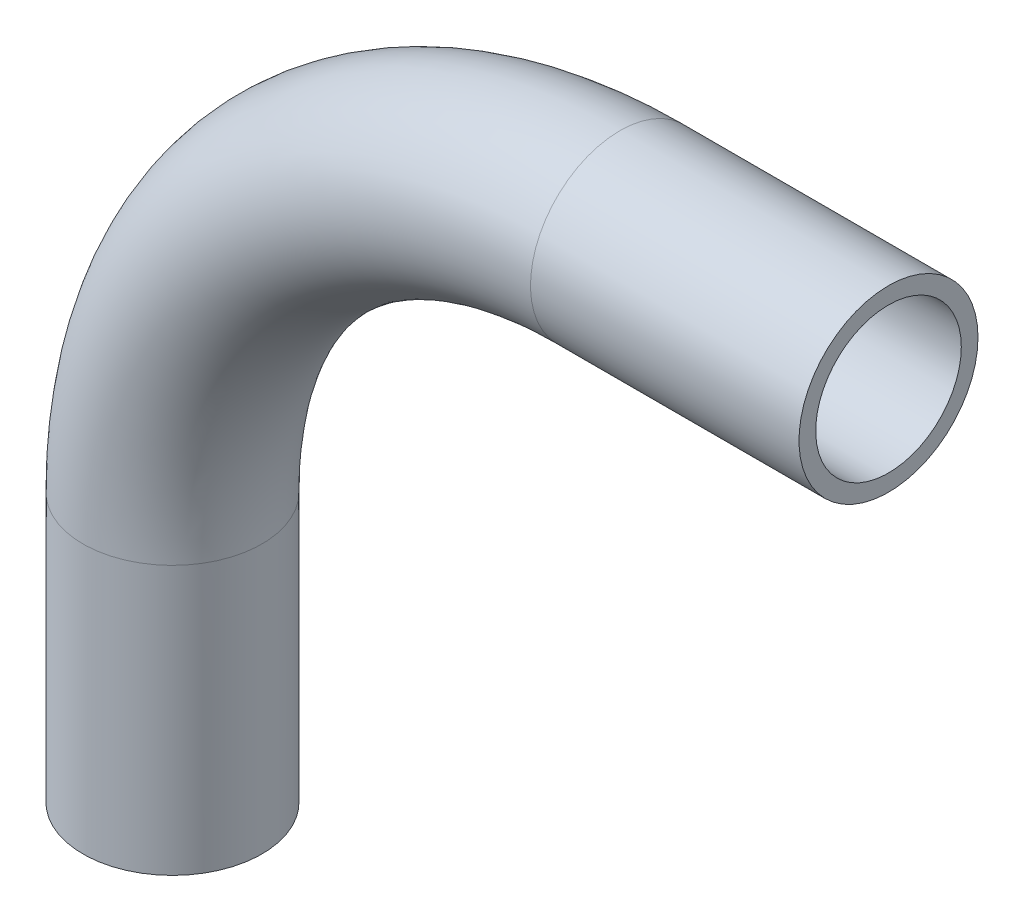
ISO-10303-21;
HEADER;
FILE_DESCRIPTION(('STEP AP214'),'2;1');
FILE_NAME('part.step','',(''),(''),'','','');
FILE_SCHEMA(('AUTOMOTIVE_DESIGN { 1 0 10303 214 1 1 1 1 }'));
ENDSEC;
DATA;
#1=APPLICATION_CONTEXT('core data for automotive mechanical design processes');
#2=APPLICATION_PROTOCOL_DEFINITION('international standard','automotive_design',2000,#1);
#3=PRODUCT_CONTEXT('',#1,'mechanical');
#4=PRODUCT('Part','Part','',(#3));
#5=PRODUCT_RELATED_PRODUCT_CATEGORY('part','',(#4));
#6=PRODUCT_DEFINITION_FORMATION('','',#4);
#7=PRODUCT_DEFINITION_CONTEXT('part definition',#1,'design');
#8=PRODUCT_DEFINITION('design','',#6,#7);
#9=PRODUCT_DEFINITION_SHAPE('','',#8);
#10=(LENGTH_UNIT() NAMED_UNIT(*) SI_UNIT(.MILLI.,.METRE.));
#11=(NAMED_UNIT(*) PLANE_ANGLE_UNIT() SI_UNIT($,.RADIAN.));
#12=(NAMED_UNIT(*) SI_UNIT($,.STERADIAN.) SOLID_ANGLE_UNIT());
#13=UNCERTAINTY_MEASURE_WITH_UNIT(LENGTH_MEASURE(1.E-05),#10,'distance_accuracy_value','');
#14=(GEOMETRIC_REPRESENTATION_CONTEXT(3) GLOBAL_UNCERTAINTY_ASSIGNED_CONTEXT((#13)) GLOBAL_UNIT_ASSIGNED_CONTEXT((#10,
#11,#12)) REPRESENTATION_CONTEXT('',''));
#15=CARTESIAN_POINT('',(0.,0.,0.));
#16=DIRECTION('',(0.,0.,1.));
#17=DIRECTION('',(1.,0.,0.));
#18=AXIS2_PLACEMENT_3D('',#15,#16,#17);
#19=CARTESIAN_POINT('',(-4.50164329221031E-13,-38.1,0.));
#20=DIRECTION('',(0.,1.,0.));
#21=DIRECTION('',(-1.,0.,0.));
#22=AXIS2_PLACEMENT_3D('',#19,#20,#21);
#23=CYLINDRICAL_SURFACE('',#22,4.7625);
#24=CARTESIAN_POINT('',(-2.81025203108243E-13,-23.8125000000001,0.));
#25=DIRECTION('',(0.,1.,0.));
#26=DIRECTION('',(0.,0.,-1.));
#27=AXIS2_PLACEMENT_3D('',#24,#25,#26);
#28=CIRCLE('',#27,4.7625);
#29=CARTESIAN_POINT('',(-4.76250000000028,-23.8125,0.));
#30=VERTEX_POINT('',#29);
#31=EDGE_CURVE('E85',#30,#30,#28,.T.);
#32=ORIENTED_EDGE('',*,*,#31,.F.);
#33=EDGE_LOOP('',(#32));
#34=FACE_BOUND('',#33,.T.);
#35=CARTESIAN_POINT('',(-4.50164329221031E-13,-38.1,0.));
#36=DIRECTION('',(0.,1.,0.));
#37=DIRECTION('',(0.,0.,-1.));
#38=AXIS2_PLACEMENT_3D('',#35,#36,#37);
#39=CIRCLE('',#38,4.7625);
#40=CARTESIAN_POINT('',(-4.50164329221031E-13,-38.1,-4.7625));
#41=VERTEX_POINT('',#40);
#42=EDGE_CURVE('E54',#41,#41,#39,.T.);
#43=ORIENTED_EDGE('',*,*,#42,.T.);
#44=EDGE_LOOP('',(#43));
#45=FACE_BOUND('',#44,.T.);
#46=ADVANCED_FACE('F39',(#34,#45),#23,.T.);
#47=CARTESIAN_POINT('',(23.8124999999997,-23.8125000000004,0.));
#48=DIRECTION('',(0.,0.,-1.));
#49=DIRECTION('',(-1.,0.,0.));
#50=AXIS2_PLACEMENT_3D('',#47,#48,#49);
#51=TOROIDAL_SURFACE('',#50,23.8125,4.7625);
#52=CARTESIAN_POINT('',(23.8125000000001,-3.629279499482E-13,0.));
#53=DIRECTION('',(1.,0.,0.));
#54=DIRECTION('',(0.,0.,-1.));
#55=AXIS2_PLACEMENT_3D('',#52,#53,#54);
#56=CIRCLE('',#55,4.7625);
#57=CARTESIAN_POINT('',(23.8125000000002,4.76249999999962,0.));
#58=VERTEX_POINT('',#57);
#59=EDGE_CURVE('E43',#58,#58,#56,.T.);
#60=CARTESIAN_POINT('',(23.8124999999997,-23.8125000000004,0.));
#61=DIRECTION('',(0.,0.,-1.));
#62=DIRECTION('',(-1.,0.,0.));
#63=AXIS2_PLACEMENT_3D('',#60,#61,#62);
#64=CIRCLE('',#63,28.575);
#65=EDGE_CURVE('',#30,#58,#64,.T.);
#66=ORIENTED_EDGE('',*,*,#31,.T.);
#67=ORIENTED_EDGE('',*,*,#59,.F.);
#68=ORIENTED_EDGE('',*,*,#65,.T.);
#69=ORIENTED_EDGE('',*,*,#65,.F.);
#70=EDGE_LOOP('',(#66,#68,#67,#69));
#71=FACE_BOUND('',#70,.T.);
#72=ADVANCED_FACE('F93',(#71),#51,.T.);
#73=CARTESIAN_POINT('',(23.8125000000001,-3.7470027081099E-13,0.));
#74=DIRECTION('',(1.,0.,0.));
#75=DIRECTION('',(0.,1.,0.));
#76=AXIS2_PLACEMENT_3D('',#73,#74,#75);
#77=CYLINDRICAL_SURFACE('',#76,4.7625);
#78=CARTESIAN_POINT('',(38.1,-5.97187481145209E-13,0.));
#79=DIRECTION('',(1.,0.,0.));
#80=DIRECTION('',(0.,0.,-1.));
#81=AXIS2_PLACEMENT_3D('',#78,#79,#80);
#82=CIRCLE('',#81,4.7625);
#83=CARTESIAN_POINT('',(38.1,-5.97187481145209E-13,-4.7625));
#84=VERTEX_POINT('',#83);
#85=EDGE_CURVE('E59',#84,#84,#82,.T.);
#86=ORIENTED_EDGE('',*,*,#85,.F.);
#87=EDGE_LOOP('',(#86));
#88=FACE_BOUND('',#87,.T.);
#89=ORIENTED_EDGE('',*,*,#59,.T.);
#90=EDGE_LOOP('',(#89));
#91=FACE_BOUND('',#90,.T.);
#92=ADVANCED_FACE('F41',(#88,#91),#77,.T.);
#93=CARTESIAN_POINT('',(-4.50164329221031E-13,-38.1,0.));
#94=DIRECTION('',(0.,1.,0.));
#95=DIRECTION('',(0.,0.,-1.));
#96=AXIS2_PLACEMENT_3D('',#93,#94,#95);
#97=PLANE('',#96);
#98=CARTESIAN_POINT('',(-4.50164329221031E-13,-38.1,0.));
#99=DIRECTION('',(0.,1.,0.));
#100=DIRECTION('',(0.,0.,-1.));
#101=AXIS2_PLACEMENT_3D('',#98,#99,#100);
#102=CIRCLE('',#101,3.8735);
#103=CARTESIAN_POINT('',(-4.50164329221031E-13,-38.1,-3.8735));
#104=VERTEX_POINT('',#103);
#105=EDGE_CURVE('E80',#104,#104,#102,.F.);
#106=ORIENTED_EDGE('',*,*,#105,.F.);
#107=EDGE_LOOP('',(#106));
#108=FACE_BOUND('',#107,.T.);
#109=ORIENTED_EDGE('',*,*,#42,.F.);
#110=EDGE_LOOP('',(#109));
#111=FACE_BOUND('',#110,.T.);
#112=ADVANCED_FACE('F99',(#108,#111),#97,.F.);
#113=CARTESIAN_POINT('',(38.1,-5.97187481145209E-13,0.));
#114=DIRECTION('',(1.,0.,0.));
#115=DIRECTION('',(0.,0.,-1.));
#116=AXIS2_PLACEMENT_3D('',#113,#114,#115);
#117=PLANE('',#116);
#118=CARTESIAN_POINT('',(38.1,-5.97187481145209E-13,0.));
#119=DIRECTION('',(1.,0.,0.));
#120=DIRECTION('',(0.,0.,-1.));
#121=AXIS2_PLACEMENT_3D('',#118,#119,#120);
#122=CIRCLE('',#121,3.8735);
#123=CARTESIAN_POINT('',(38.1,-5.97187481145209E-13,-3.8735));
#124=VERTEX_POINT('',#123);
#125=EDGE_CURVE('E11',#124,#124,#122,.F.);
#126=ORIENTED_EDGE('',*,*,#125,.T.);
#127=EDGE_LOOP('',(#126));
#128=FACE_BOUND('',#127,.T.);
#129=ORIENTED_EDGE('',*,*,#85,.T.);
#130=EDGE_LOOP('',(#129));
#131=FACE_BOUND('',#130,.T.);
#132=ADVANCED_FACE('F66',(#128,#131),#117,.T.);
#133=CARTESIAN_POINT('',(-4.50164329221031E-13,-38.1,0.));
#134=DIRECTION('',(0.,1.,0.));
#135=DIRECTION('',(-1.,0.,0.));
#136=AXIS2_PLACEMENT_3D('',#133,#134,#135);
#137=CYLINDRICAL_SURFACE('',#136,3.8735);
#138=CARTESIAN_POINT('',(-2.81025203108243E-13,-23.8125000000001,0.));
#139=DIRECTION('',(0.,1.,0.));
#140=DIRECTION('',(0.,0.,-1.));
#141=AXIS2_PLACEMENT_3D('',#138,#139,#140);
#142=CIRCLE('',#141,3.8735);
#143=CARTESIAN_POINT('',(-3.87350000000029,-23.8125,0.));
#144=VERTEX_POINT('',#143);
#145=EDGE_CURVE('E77',#144,#144,#142,.F.);
#146=ORIENTED_EDGE('',*,*,#145,.F.);
#147=EDGE_LOOP('',(#146));
#148=FACE_BOUND('',#147,.T.);
#149=ORIENTED_EDGE('',*,*,#105,.T.);
#150=EDGE_LOOP('',(#149));
#151=FACE_BOUND('',#150,.T.);
#152=ADVANCED_FACE('F107',(#148,#151),#137,.F.);
#153=CARTESIAN_POINT('',(23.8124999999997,-23.8125000000004,0.));
#154=DIRECTION('',(0.,0.,-1.));
#155=DIRECTION('',(-1.,0.,0.));
#156=AXIS2_PLACEMENT_3D('',#153,#154,#155);
#157=TOROIDAL_SURFACE('',#156,23.8125,3.8735);
#158=CARTESIAN_POINT('',(23.8125000000001,-3.629279499482E-13,0.));
#159=DIRECTION('',(1.,0.,0.));
#160=DIRECTION('',(0.,0.,-1.));
#161=AXIS2_PLACEMENT_3D('',#158,#159,#160);
#162=CIRCLE('',#161,3.8735);
#163=CARTESIAN_POINT('',(23.8125000000002,3.87349999999963,0.));
#164=VERTEX_POINT('',#163);
#165=EDGE_CURVE('E48',#164,#164,#162,.F.);
#166=CARTESIAN_POINT('',(23.8124999999997,-23.8125000000004,0.));
#167=DIRECTION('',(0.,0.,-1.));
#168=DIRECTION('',(-1.,0.,0.));
#169=AXIS2_PLACEMENT_3D('',#166,#167,#168);
#170=CIRCLE('',#169,27.686);
#171=EDGE_CURVE('',#144,#164,#170,.T.);
#172=ORIENTED_EDGE('',*,*,#145,.T.);
#173=ORIENTED_EDGE('',*,*,#165,.F.);
#174=ORIENTED_EDGE('',*,*,#171,.T.);
#175=ORIENTED_EDGE('',*,*,#171,.F.);
#176=EDGE_LOOP('',(#172,#174,#173,#175));
#177=FACE_BOUND('',#176,.T.);
#178=ADVANCED_FACE('F72',(#177),#157,.F.);
#179=CARTESIAN_POINT('',(23.8125000000001,-3.7470027081099E-13,0.));
#180=DIRECTION('',(1.,0.,0.));
#181=DIRECTION('',(0.,1.,0.));
#182=AXIS2_PLACEMENT_3D('',#179,#180,#181);
#183=CYLINDRICAL_SURFACE('',#182,3.8735);
#184=ORIENTED_EDGE('',*,*,#125,.F.);
#185=EDGE_LOOP('',(#184));
#186=FACE_BOUND('',#185,.T.);
#187=ORIENTED_EDGE('',*,*,#165,.T.);
#188=EDGE_LOOP('',(#187));
#189=FACE_BOUND('',#188,.T.);
#190=ADVANCED_FACE('F69',(#186,#189),#183,.F.);
#191=CLOSED_SHELL('',(#46,#72,#92,#112,#132,#152,#178,#190));
#192=MANIFOLD_SOLID_BREP('B2',#191);
#193=ADVANCED_BREP_SHAPE_REPRESENTATION('',(#18,#192),#14);
#194=SHAPE_DEFINITION_REPRESENTATION(#9,#193);
ENDSEC;
END-ISO-10303-21;
